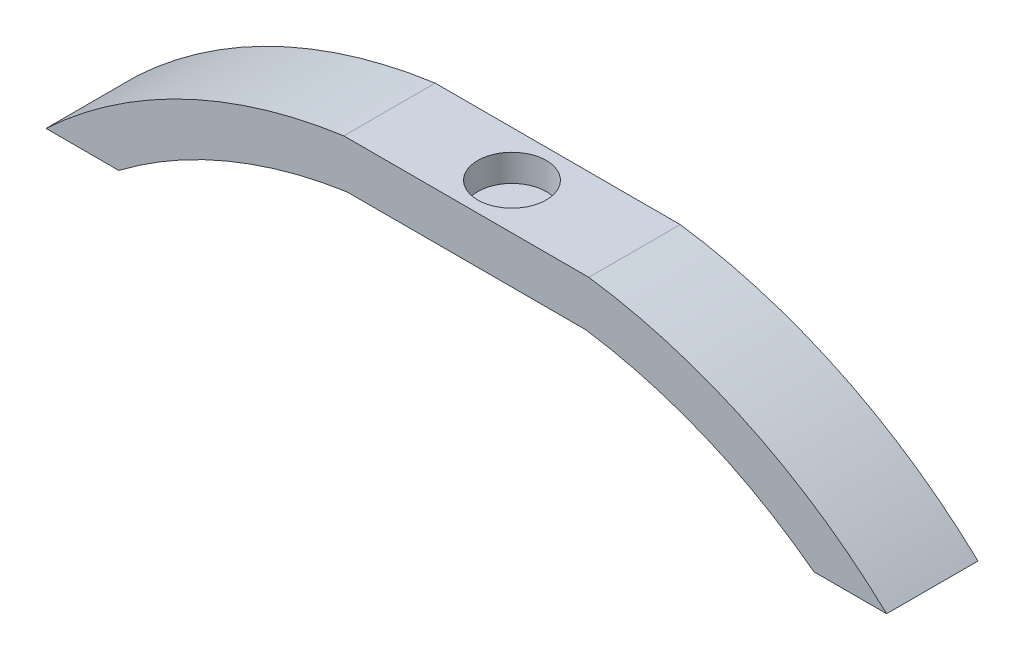
ISO-10303-21;
HEADER;
FILE_DESCRIPTION(('STEP AP214'),'2;1');
FILE_NAME('part.step','',(''),(''),'','','');
FILE_SCHEMA(('AUTOMOTIVE_DESIGN { 1 0 10303 214 1 1 1 1 }'));
ENDSEC;
DATA;
#1=APPLICATION_CONTEXT('core data for automotive mechanical design processes');
#2=APPLICATION_PROTOCOL_DEFINITION('international standard','automotive_design',2000,#1);
#3=PRODUCT_CONTEXT('',#1,'mechanical');
#4=PRODUCT('Part','Part','',(#3));
#5=PRODUCT_RELATED_PRODUCT_CATEGORY('part','',(#4));
#6=PRODUCT_DEFINITION_FORMATION('','',#4);
#7=PRODUCT_DEFINITION_CONTEXT('part definition',#1,'design');
#8=PRODUCT_DEFINITION('design','',#6,#7);
#9=PRODUCT_DEFINITION_SHAPE('','',#8);
#10=(LENGTH_UNIT() NAMED_UNIT(*) SI_UNIT(.MILLI.,.METRE.));
#11=(NAMED_UNIT(*) PLANE_ANGLE_UNIT() SI_UNIT($,.RADIAN.));
#12=(NAMED_UNIT(*) SI_UNIT($,.STERADIAN.) SOLID_ANGLE_UNIT());
#13=UNCERTAINTY_MEASURE_WITH_UNIT(LENGTH_MEASURE(1.E-05),#10,'distance_accuracy_value','');
#14=(GEOMETRIC_REPRESENTATION_CONTEXT(3) GLOBAL_UNCERTAINTY_ASSIGNED_CONTEXT((#13)) GLOBAL_UNIT_ASSIGNED_CONTEXT((#10,
#11,#12)) REPRESENTATION_CONTEXT('',''));
#15=CARTESIAN_POINT('',(0.,0.,0.));
#16=DIRECTION('',(0.,0.,1.));
#17=DIRECTION('',(1.,0.,0.));
#18=AXIS2_PLACEMENT_3D('',#15,#16,#17);
#19=CARTESIAN_POINT('',(-5.26989679487612,0.,10.16));
#20=DIRECTION('',(0.,0.,-1.));
#21=DIRECTION('',(-1.,0.,0.));
#22=AXIS2_PLACEMENT_3D('',#19,#20,#21);
#23=CYLINDRICAL_SURFACE('',#22,60.57);
#24=CARTESIAN_POINT('',(-5.26989679487612,0.,0.));
#25=DIRECTION('',(0.,0.,1.));
#26=DIRECTION('',(1.,0.,0.));
#27=AXIS2_PLACEMENT_3D('',#24,#25,#26);
#28=CIRCLE('',#27,60.57);
#29=CARTESIAN_POINT('',(-13.62,59.9916717258636,0.));
#30=VERTEX_POINT('',#29);
#31=CARTESIAN_POINT('',(-46.735,44.1516717258636,0.));
#32=VERTEX_POINT('',#31);
#33=EDGE_CURVE('E146',#30,#32,#28,.T.);
#34=ORIENTED_EDGE('',*,*,#33,.T.);
#35=DIRECTION('',(0.,0.,-1.));
#36=VECTOR('',#35,1.);
#37=CARTESIAN_POINT('',(-46.735,44.1516717258636,10.16));
#38=LINE('',#37,#36);
#39=CARTESIAN_POINT('',(-46.735,44.1516717258636,10.16));
#40=VERTEX_POINT('',#39);
#41=EDGE_CURVE('E11',#40,#32,#38,.T.);
#42=ORIENTED_EDGE('',*,*,#41,.F.);
#43=CARTESIAN_POINT('',(-5.26989679487612,0.,10.16));
#44=DIRECTION('',(0.,0.,1.));
#45=DIRECTION('',(1.,0.,0.));
#46=AXIS2_PLACEMENT_3D('',#43,#44,#45);
#47=CIRCLE('',#46,60.57);
#48=CARTESIAN_POINT('',(-13.62,59.9916717258636,10.16));
#49=VERTEX_POINT('',#48);
#50=EDGE_CURVE('E169',#49,#40,#47,.T.);
#51=ORIENTED_EDGE('',*,*,#50,.F.);
#52=DIRECTION('',(0.,0.,-1.));
#53=VECTOR('',#52,1.);
#54=CARTESIAN_POINT('',(-13.62,59.9916717258636,10.16));
#55=LINE('',#54,#53);
#56=EDGE_CURVE('E142',#49,#30,#55,.T.);
#57=ORIENTED_EDGE('',*,*,#56,.T.);
#58=EDGE_LOOP('',(#34,#42,#51,#57));
#59=FACE_BOUND('',#58,.T.);
#60=ADVANCED_FACE('F45',(#59),#23,.T.);
#61=CARTESIAN_POINT('',(-46.735,44.1516717258636,10.16));
#62=DIRECTION('',(0.,1.,0.));
#63=DIRECTION('',(0.,0.,1.));
#64=AXIS2_PLACEMENT_3D('',#61,#62,#63);
#65=PLANE('',#64);
#66=DIRECTION('',(1.,0.,0.));
#67=VECTOR('',#66,1.);
#68=CARTESIAN_POINT('',(-46.735,44.1516717258636,0.));
#69=LINE('',#68,#67);
#70=CARTESIAN_POINT('',(-38.6503159625795,44.1516717258636,0.));
#71=VERTEX_POINT('',#70);
#72=EDGE_CURVE('E150',#32,#71,#69,.T.);
#73=ORIENTED_EDGE('',*,*,#72,.T.);
#74=DIRECTION('',(0.,0.,-1.));
#75=VECTOR('',#74,1.);
#76=CARTESIAN_POINT('',(-38.6503159625795,44.1516717258636,10.16));
#77=LINE('',#76,#75);
#78=CARTESIAN_POINT('',(-38.6503159625795,44.1516717258636,10.16));
#79=VERTEX_POINT('',#78);
#80=EDGE_CURVE('E54',#79,#71,#77,.T.);
#81=ORIENTED_EDGE('',*,*,#80,.F.);
#82=DIRECTION('',(1.,0.,0.));
#83=VECTOR('',#82,1.);
#84=CARTESIAN_POINT('',(-46.735,44.1516717258636,10.16));
#85=LINE('',#84,#83);
#86=EDGE_CURVE('E105',#40,#79,#85,.T.);
#87=ORIENTED_EDGE('',*,*,#86,.F.);
#88=ORIENTED_EDGE('',*,*,#41,.T.);
#89=EDGE_LOOP('',(#73,#81,#87,#88));
#90=FACE_BOUND('',#89,.T.);
#91=ADVANCED_FACE('F241',(#90),#65,.F.);
#92=CARTESIAN_POINT('',(-5.26989679487612,0.,10.16));
#93=DIRECTION('',(0.,0.,-1.));
#94=DIRECTION('',(-1.,0.,0.));
#95=AXIS2_PLACEMENT_3D('',#92,#93,#94);
#96=CYLINDRICAL_SURFACE('',#95,55.35);
#97=CARTESIAN_POINT('',(-5.26989679487612,0.,0.));
#98=DIRECTION('',(0.,0.,-1.));
#99=DIRECTION('',(1.,0.,0.));
#100=AXIS2_PLACEMENT_3D('',#97,#98,#99);
#101=CIRCLE('',#100,55.35);
#102=CARTESIAN_POINT('',(-13.250277509744,54.7716717258636,0.));
#103=VERTEX_POINT('',#102);
#104=EDGE_CURVE('E154',#71,#103,#101,.T.);
#105=ORIENTED_EDGE('',*,*,#104,.T.);
#106=DIRECTION('',(0.,0.,-1.));
#107=VECTOR('',#106,1.);
#108=CARTESIAN_POINT('',(-13.250277509744,54.7716717258636,10.16));
#109=LINE('',#108,#107);
#110=CARTESIAN_POINT('',(-13.250277509744,54.7716717258636,10.16));
#111=VERTEX_POINT('',#110);
#112=EDGE_CURVE('E180',#111,#103,#109,.T.);
#113=ORIENTED_EDGE('',*,*,#112,.F.);
#114=CARTESIAN_POINT('',(-5.26989679487612,0.,10.16));
#115=DIRECTION('',(0.,0.,-1.));
#116=DIRECTION('',(1.,0.,0.));
#117=AXIS2_PLACEMENT_3D('',#114,#115,#116);
#118=CIRCLE('',#117,55.35);
#119=EDGE_CURVE('E190',#79,#111,#118,.T.);
#120=ORIENTED_EDGE('',*,*,#119,.F.);
#121=ORIENTED_EDGE('',*,*,#80,.T.);
#122=EDGE_LOOP('',(#105,#113,#120,#121));
#123=FACE_BOUND('',#122,.T.);
#124=ADVANCED_FACE('F188',(#123),#96,.F.);
#125=CARTESIAN_POINT('',(-13.250277509744,54.7716717258636,10.16));
#126=DIRECTION('',(0.,1.,0.));
#127=DIRECTION('',(0.,0.,1.));
#128=AXIS2_PLACEMENT_3D('',#125,#126,#127);
#129=PLANE('',#128);
#130=DIRECTION('',(1.,0.,0.));
#131=VECTOR('',#130,1.);
#132=CARTESIAN_POINT('',(-13.250277509744,54.7716717258636,0.));
#133=LINE('',#132,#131);
#134=CARTESIAN_POINT('',(13.250277509744,54.7716717258636,0.));
#135=VERTEX_POINT('',#134);
#136=EDGE_CURVE('E157',#103,#135,#133,.T.);
#137=ORIENTED_EDGE('',*,*,#136,.T.);
#138=DIRECTION('',(0.,0.,-1.));
#139=VECTOR('',#138,1.);
#140=CARTESIAN_POINT('',(13.250277509744,54.7716717258636,10.16));
#141=LINE('',#140,#139);
#142=CARTESIAN_POINT('',(13.250277509744,54.7716717258636,10.16));
#143=VERTEX_POINT('',#142);
#144=EDGE_CURVE('E176',#143,#135,#141,.T.);
#145=ORIENTED_EDGE('',*,*,#144,.F.);
#146=DIRECTION('',(1.,0.,0.));
#147=VECTOR('',#146,1.);
#148=CARTESIAN_POINT('',(-13.250277509744,54.7716717258636,10.16));
#149=LINE('',#148,#147);
#150=EDGE_CURVE('E203',#111,#143,#149,.T.);
#151=ORIENTED_EDGE('',*,*,#150,.F.);
#152=ORIENTED_EDGE('',*,*,#112,.T.);
#153=EDGE_LOOP('',(#137,#145,#151,#152));
#154=FACE_BOUND('',#153,.T.);
#155=ADVANCED_FACE('F198',(#154),#129,.F.);
#156=CARTESIAN_POINT('',(5.26989679487604,0.,10.16));
#157=DIRECTION('',(0.,0.,-1.));
#158=DIRECTION('',(-1.,0.,0.));
#159=AXIS2_PLACEMENT_3D('',#156,#157,#158);
#160=CYLINDRICAL_SURFACE('',#159,55.35);
#161=CARTESIAN_POINT('',(5.26989679487604,0.,0.));
#162=DIRECTION('',(0.,0.,-1.));
#163=DIRECTION('',(1.,0.,0.));
#164=AXIS2_PLACEMENT_3D('',#161,#162,#163);
#165=CIRCLE('',#164,55.35);
#166=CARTESIAN_POINT('',(38.6503159625794,44.1516717258636,0.));
#167=VERTEX_POINT('',#166);
#168=EDGE_CURVE('E160',#135,#167,#165,.T.);
#169=ORIENTED_EDGE('',*,*,#168,.T.);
#170=DIRECTION('',(0.,0.,-1.));
#171=VECTOR('',#170,1.);
#172=CARTESIAN_POINT('',(38.6503159625794,44.1516717258636,10.16));
#173=LINE('',#172,#171);
#174=CARTESIAN_POINT('',(38.6503159625794,44.1516717258636,10.16));
#175=VERTEX_POINT('',#174);
#176=EDGE_CURVE('E135',#175,#167,#173,.T.);
#177=ORIENTED_EDGE('',*,*,#176,.F.);
#178=CARTESIAN_POINT('',(5.26989679487604,0.,10.16));
#179=DIRECTION('',(0.,0.,-1.));
#180=DIRECTION('',(1.,0.,0.));
#181=AXIS2_PLACEMENT_3D('',#178,#179,#180);
#182=CIRCLE('',#181,55.35);
#183=EDGE_CURVE('E124',#143,#175,#182,.T.);
#184=ORIENTED_EDGE('',*,*,#183,.F.);
#185=ORIENTED_EDGE('',*,*,#144,.T.);
#186=EDGE_LOOP('',(#169,#177,#184,#185));
#187=FACE_BOUND('',#186,.T.);
#188=ADVANCED_FACE('F201',(#187),#160,.F.);
#189=CARTESIAN_POINT('',(46.735,44.1516717258636,10.16));
#190=DIRECTION('',(0.,1.,0.));
#191=DIRECTION('',(-1.,0.,0.));
#192=AXIS2_PLACEMENT_3D('',#189,#190,#191);
#193=PLANE('',#192);
#194=DIRECTION('',(1.,0.,0.));
#195=VECTOR('',#194,1.);
#196=CARTESIAN_POINT('',(46.735,44.1516717258636,0.));
#197=LINE('',#196,#195);
#198=CARTESIAN_POINT('',(46.735,44.1516717258636,0.));
#199=VERTEX_POINT('',#198);
#200=EDGE_CURVE('E133',#167,#199,#197,.T.);
#201=ORIENTED_EDGE('',*,*,#200,.T.);
#202=DIRECTION('',(0.,0.,-1.));
#203=VECTOR('',#202,1.);
#204=CARTESIAN_POINT('',(46.735,44.1516717258636,10.16));
#205=LINE('',#204,#203);
#206=CARTESIAN_POINT('',(46.735,44.1516717258636,10.16));
#207=VERTEX_POINT('',#206);
#208=EDGE_CURVE('E130',#207,#199,#205,.T.);
#209=ORIENTED_EDGE('',*,*,#208,.F.);
#210=DIRECTION('',(1.,0.,0.));
#211=VECTOR('',#210,1.);
#212=CARTESIAN_POINT('',(46.735,44.1516717258636,10.16));
#213=LINE('',#212,#211);
#214=EDGE_CURVE('E118',#175,#207,#213,.T.);
#215=ORIENTED_EDGE('',*,*,#214,.F.);
#216=ORIENTED_EDGE('',*,*,#176,.T.);
#217=EDGE_LOOP('',(#201,#209,#215,#216));
#218=FACE_BOUND('',#217,.T.);
#219=ADVANCED_FACE('F131',(#218),#193,.F.);
#220=CARTESIAN_POINT('',(5.26989679487604,0.,10.16));
#221=DIRECTION('',(0.,0.,-1.));
#222=DIRECTION('',(-1.,0.,0.));
#223=AXIS2_PLACEMENT_3D('',#220,#221,#222);
#224=CYLINDRICAL_SURFACE('',#223,60.57);
#225=CARTESIAN_POINT('',(5.26989679487604,0.,0.));
#226=DIRECTION('',(0.,0.,1.));
#227=DIRECTION('',(1.,0.,0.));
#228=AXIS2_PLACEMENT_3D('',#225,#226,#227);
#229=CIRCLE('',#228,60.57);
#230=CARTESIAN_POINT('',(13.62,59.9916717258636,0.));
#231=VERTEX_POINT('',#230);
#232=EDGE_CURVE('E91',#199,#231,#229,.T.);
#233=ORIENTED_EDGE('',*,*,#232,.T.);
#234=DIRECTION('',(0.,0.,-1.));
#235=VECTOR('',#234,1.);
#236=CARTESIAN_POINT('',(13.62,59.9916717258636,10.16));
#237=LINE('',#236,#235);
#238=CARTESIAN_POINT('',(13.62,59.9916717258636,10.16));
#239=VERTEX_POINT('',#238);
#240=EDGE_CURVE('E136',#239,#231,#237,.T.);
#241=ORIENTED_EDGE('',*,*,#240,.F.);
#242=CARTESIAN_POINT('',(5.26989679487604,0.,10.16));
#243=DIRECTION('',(0.,0.,1.));
#244=DIRECTION('',(1.,0.,0.));
#245=AXIS2_PLACEMENT_3D('',#242,#243,#244);
#246=CIRCLE('',#245,60.57);
#247=EDGE_CURVE('E122',#207,#239,#246,.T.);
#248=ORIENTED_EDGE('',*,*,#247,.F.);
#249=ORIENTED_EDGE('',*,*,#208,.T.);
#250=EDGE_LOOP('',(#233,#241,#248,#249));
#251=FACE_BOUND('',#250,.T.);
#252=ADVANCED_FACE('F138',(#251),#224,.T.);
#253=CARTESIAN_POINT('',(-13.62,59.9916717258636,10.16));
#254=DIRECTION('',(0.,-1.,0.));
#255=DIRECTION('',(1.,0.,0.));
#256=AXIS2_PLACEMENT_3D('',#253,#254,#255);
#257=PLANE('',#256);
#258=CARTESIAN_POINT('',(0.,59.9916717258636,5.08));
#259=DIRECTION('',(0.,1.,0.));
#260=DIRECTION('',(0.,0.,1.));
#261=AXIS2_PLACEMENT_3D('',#258,#259,#260);
#262=CIRCLE('',#261,3.81);
#263=CARTESIAN_POINT('',(0.,59.9916717258636,8.89));
#264=VERTEX_POINT('',#263);
#265=EDGE_CURVE('E213',#264,#264,#262,.T.);
#266=ORIENTED_EDGE('',*,*,#265,.F.);
#267=EDGE_LOOP('',(#266));
#268=FACE_BOUND('',#267,.T.);
#269=DIRECTION('',(-1.,0.,0.));
#270=VECTOR('',#269,1.);
#271=CARTESIAN_POINT('',(-13.62,59.9916717258636,0.));
#272=LINE('',#271,#270);
#273=EDGE_CURVE('E97',#231,#30,#272,.T.);
#274=ORIENTED_EDGE('',*,*,#273,.T.);
#275=ORIENTED_EDGE('',*,*,#56,.F.);
#276=DIRECTION('',(-1.,0.,0.));
#277=VECTOR('',#276,1.);
#278=CARTESIAN_POINT('',(-13.62,59.9916717258636,10.16));
#279=LINE('',#278,#277);
#280=EDGE_CURVE('E62',#239,#49,#279,.T.);
#281=ORIENTED_EDGE('',*,*,#280,.F.);
#282=ORIENTED_EDGE('',*,*,#240,.T.);
#283=EDGE_LOOP('',(#274,#275,#281,#282));
#284=FACE_BOUND('',#283,.T.);
#285=ADVANCED_FACE('F229',(#268,#284),#257,.F.);
#286=CARTESIAN_POINT('',(-5.26989679487612,0.,10.16));
#287=DIRECTION('',(0.,0.,1.));
#288=DIRECTION('',(1.,0.,0.));
#289=AXIS2_PLACEMENT_3D('',#286,#287,#288);
#290=PLANE('',#289);
#291=ORIENTED_EDGE('',*,*,#50,.T.);
#292=ORIENTED_EDGE('',*,*,#86,.T.);
#293=ORIENTED_EDGE('',*,*,#119,.T.);
#294=ORIENTED_EDGE('',*,*,#150,.T.);
#295=ORIENTED_EDGE('',*,*,#183,.T.);
#296=ORIENTED_EDGE('',*,*,#214,.T.);
#297=ORIENTED_EDGE('',*,*,#247,.T.);
#298=ORIENTED_EDGE('',*,*,#280,.T.);
#299=EDGE_LOOP('',(#291,#292,#293,#294,#295,#296,#297,#298));
#300=FACE_BOUND('',#299,.T.);
#301=ADVANCED_FACE('F120',(#300),#290,.T.);
#302=CARTESIAN_POINT('',(-5.26989679487612,0.,0.));
#303=DIRECTION('',(0.,0.,1.));
#304=DIRECTION('',(1.,0.,0.));
#305=AXIS2_PLACEMENT_3D('',#302,#303,#304);
#306=PLANE('',#305);
#307=ORIENTED_EDGE('',*,*,#33,.F.);
#308=ORIENTED_EDGE('',*,*,#273,.F.);
#309=ORIENTED_EDGE('',*,*,#232,.F.);
#310=ORIENTED_EDGE('',*,*,#200,.F.);
#311=ORIENTED_EDGE('',*,*,#168,.F.);
#312=ORIENTED_EDGE('',*,*,#136,.F.);
#313=ORIENTED_EDGE('',*,*,#104,.F.);
#314=ORIENTED_EDGE('',*,*,#72,.F.);
#315=EDGE_LOOP('',(#307,#308,#309,#310,#311,#312,#313,#314));
#316=FACE_BOUND('',#315,.T.);
#317=ADVANCED_FACE('F194',(#316),#306,.F.);
#318=CARTESIAN_POINT('',(0.,56.9916717258636,5.08));
#319=DIRECTION('',(0.,1.,0.));
#320=DIRECTION('',(0.,0.,1.));
#321=AXIS2_PLACEMENT_3D('',#318,#319,#320);
#322=CYLINDRICAL_SURFACE('',#321,3.81);
#323=CARTESIAN_POINT('',(0.,56.9916717258636,5.08));
#324=DIRECTION('',(0.,1.,0.));
#325=DIRECTION('',(0.,0.,1.));
#326=AXIS2_PLACEMENT_3D('',#323,#324,#325);
#327=CIRCLE('',#326,3.81);
#328=CARTESIAN_POINT('',(0.,56.9916717258636,8.89));
#329=VERTEX_POINT('',#328);
#330=EDGE_CURVE('E151',#329,#329,#327,.T.);
#331=ORIENTED_EDGE('',*,*,#330,.F.);
#332=EDGE_LOOP('',(#331));
#333=FACE_BOUND('',#332,.T.);
#334=ORIENTED_EDGE('',*,*,#265,.T.);
#335=EDGE_LOOP('',(#334));
#336=FACE_BOUND('',#335,.T.);
#337=ADVANCED_FACE('F223',(#333,#336),#322,.F.);
#338=CARTESIAN_POINT('',(0.,56.9916717258636,5.08));
#339=DIRECTION('',(0.,1.,0.));
#340=DIRECTION('',(0.,0.,1.));
#341=AXIS2_PLACEMENT_3D('',#338,#339,#340);
#342=PLANE('',#341);
#343=ORIENTED_EDGE('',*,*,#330,.T.);
#344=EDGE_LOOP('',(#343));
#345=FACE_BOUND('',#344,.T.);
#346=ADVANCED_FACE('F221',(#345),#342,.T.);
#347=CLOSED_SHELL('',(#60,#91,#124,#155,#188,#219,#252,#285,#301,#317,#337,#346));
#348=MANIFOLD_SOLID_BREP('B2',#347);
#349=ADVANCED_BREP_SHAPE_REPRESENTATION('',(#18,#348),#14);
#350=SHAPE_DEFINITION_REPRESENTATION(#9,#349);
ENDSEC;
END-ISO-10303-21;
